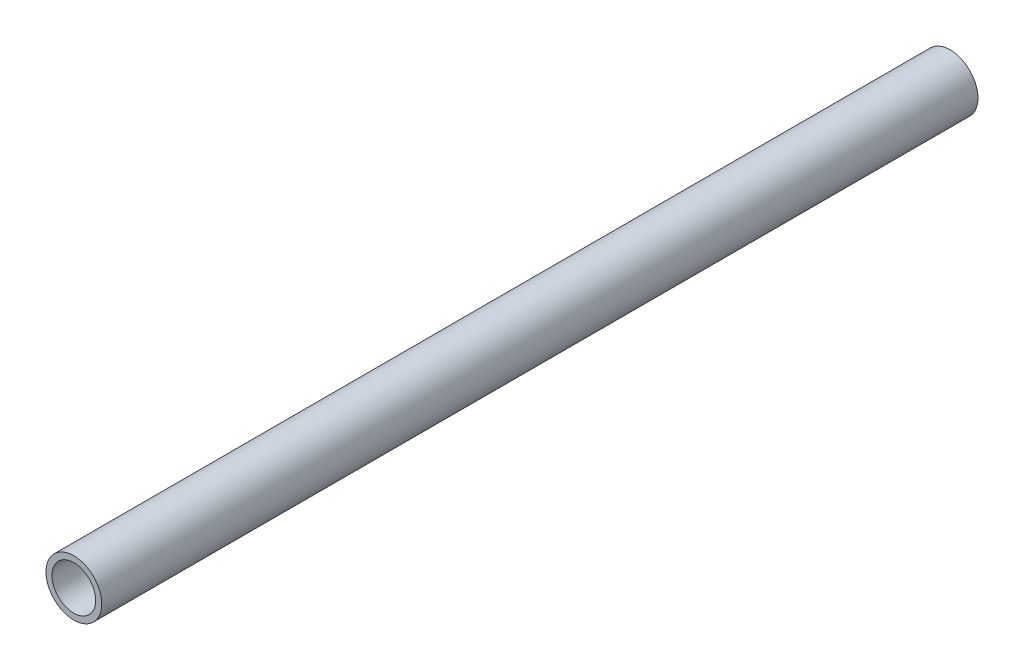
ISO-10303-21;
HEADER;
FILE_DESCRIPTION(('STEP AP214'),'2;1');
FILE_NAME('part.step','',(''),(''),'','','');
FILE_SCHEMA(('AUTOMOTIVE_DESIGN { 1 0 10303 214 1 1 1 1 }'));
ENDSEC;
DATA;
#1=APPLICATION_CONTEXT('core data for automotive mechanical design processes');
#2=APPLICATION_PROTOCOL_DEFINITION('international standard','automotive_design',2000,#1);
#3=PRODUCT_CONTEXT('',#1,'mechanical');
#4=PRODUCT('Part','Part','',(#3));
#5=PRODUCT_RELATED_PRODUCT_CATEGORY('part','',(#4));
#6=PRODUCT_DEFINITION_FORMATION('','',#4);
#7=PRODUCT_DEFINITION_CONTEXT('part definition',#1,'design');
#8=PRODUCT_DEFINITION('design','',#6,#7);
#9=PRODUCT_DEFINITION_SHAPE('','',#8);
#10=(LENGTH_UNIT() NAMED_UNIT(*) SI_UNIT(.MILLI.,.METRE.));
#11=(NAMED_UNIT(*) PLANE_ANGLE_UNIT() SI_UNIT($,.RADIAN.));
#12=(NAMED_UNIT(*) SI_UNIT($,.STERADIAN.) SOLID_ANGLE_UNIT());
#13=UNCERTAINTY_MEASURE_WITH_UNIT(LENGTH_MEASURE(1.E-05),#10,'distance_accuracy_value','');
#14=(GEOMETRIC_REPRESENTATION_CONTEXT(3) GLOBAL_UNCERTAINTY_ASSIGNED_CONTEXT((#13)) GLOBAL_UNIT_ASSIGNED_CONTEXT((#10,
#11,#12)) REPRESENTATION_CONTEXT('',''));
#15=CARTESIAN_POINT('',(0.,0.,0.));
#16=DIRECTION('',(0.,0.,1.));
#17=DIRECTION('',(1.,0.,0.));
#18=AXIS2_PLACEMENT_3D('',#15,#16,#17);
#19=CARTESIAN_POINT('',(0.,0.,419.1));
#20=DIRECTION('',(0.,0.,1.));
#21=DIRECTION('',(1.,0.,0.));
#22=AXIS2_PLACEMENT_3D('',#19,#20,#21);
#23=PLANE('',#22);
#24=CARTESIAN_POINT('',(0.,0.,419.1));
#25=DIRECTION('',(0.,0.,1.));
#26=DIRECTION('',(1.,0.,0.));
#27=AXIS2_PLACEMENT_3D('',#24,#25,#26);
#28=CIRCLE('',#27,13.335);
#29=CARTESIAN_POINT('',(13.335,0.,419.1));
#30=VERTEX_POINT('',#29);
#31=EDGE_CURVE('E10',#30,#30,#28,.T.);
#32=ORIENTED_EDGE('',*,*,#31,.T.);
#33=EDGE_LOOP('',(#32));
#34=FACE_BOUND('',#33,.T.);
#35=CARTESIAN_POINT('',(0.,0.,419.1));
#36=DIRECTION('',(0.,0.,1.));
#37=DIRECTION('',(1.,0.,0.));
#38=AXIS2_PLACEMENT_3D('',#35,#36,#37);
#39=CIRCLE('',#38,10.4648);
#40=CARTESIAN_POINT('',(10.4648,0.,419.1));
#41=VERTEX_POINT('',#40);
#42=EDGE_CURVE('E39',#41,#41,#39,.T.);
#43=ORIENTED_EDGE('',*,*,#42,.F.);
#44=EDGE_LOOP('',(#43));
#45=FACE_BOUND('',#44,.T.);
#46=ADVANCED_FACE('F28',(#34,#45),#23,.T.);
#47=CARTESIAN_POINT('',(0.,0.,0.));
#48=DIRECTION('',(0.,0.,1.));
#49=DIRECTION('',(1.,0.,0.));
#50=AXIS2_PLACEMENT_3D('',#47,#48,#49);
#51=PLANE('',#50);
#52=CARTESIAN_POINT('',(0.,0.,0.));
#53=DIRECTION('',(0.,0.,1.));
#54=DIRECTION('',(1.,0.,0.));
#55=AXIS2_PLACEMENT_3D('',#52,#53,#54);
#56=CIRCLE('',#55,13.335);
#57=CARTESIAN_POINT('',(13.335,0.,0.));
#58=VERTEX_POINT('',#57);
#59=EDGE_CURVE('E32',#58,#58,#56,.T.);
#60=ORIENTED_EDGE('',*,*,#59,.F.);
#61=EDGE_LOOP('',(#60));
#62=FACE_BOUND('',#61,.T.);
#63=CARTESIAN_POINT('',(0.,0.,0.));
#64=DIRECTION('',(0.,0.,1.));
#65=DIRECTION('',(1.,0.,0.));
#66=AXIS2_PLACEMENT_3D('',#63,#64,#65);
#67=CIRCLE('',#66,10.4648);
#68=CARTESIAN_POINT('',(10.4648,0.,0.));
#69=VERTEX_POINT('',#68);
#70=EDGE_CURVE('E41',#69,#69,#67,.T.);
#71=ORIENTED_EDGE('',*,*,#70,.T.);
#72=EDGE_LOOP('',(#71));
#73=FACE_BOUND('',#72,.T.);
#74=ADVANCED_FACE('F51',(#62,#73),#51,.F.);
#75=CARTESIAN_POINT('',(0.,0.,419.1));
#76=DIRECTION('',(0.,0.,-1.));
#77=DIRECTION('',(-1.,0.,0.));
#78=AXIS2_PLACEMENT_3D('',#75,#76,#77);
#79=CYLINDRICAL_SURFACE('',#78,13.335);
#80=ORIENTED_EDGE('',*,*,#31,.F.);
#81=EDGE_LOOP('',(#80));
#82=FACE_BOUND('',#81,.T.);
#83=ORIENTED_EDGE('',*,*,#59,.T.);
#84=EDGE_LOOP('',(#83));
#85=FACE_BOUND('',#84,.T.);
#86=ADVANCED_FACE('F30',(#82,#85),#79,.T.);
#87=CARTESIAN_POINT('',(0.,0.,419.1));
#88=DIRECTION('',(0.,0.,-1.));
#89=DIRECTION('',(-1.,0.,0.));
#90=AXIS2_PLACEMENT_3D('',#87,#88,#89);
#91=CYLINDRICAL_SURFACE('',#90,10.4648);
#92=ORIENTED_EDGE('',*,*,#42,.T.);
#93=EDGE_LOOP('',(#92));
#94=FACE_BOUND('',#93,.T.);
#95=ORIENTED_EDGE('',*,*,#70,.F.);
#96=EDGE_LOOP('',(#95));
#97=FACE_BOUND('',#96,.T.);
#98=ADVANCED_FACE('F47',(#94,#97),#91,.F.);
#99=CLOSED_SHELL('',(#46,#74,#86,#98));
#100=MANIFOLD_SOLID_BREP('B2',#99);
#101=ADVANCED_BREP_SHAPE_REPRESENTATION('',(#18,#100),#14);
#102=SHAPE_DEFINITION_REPRESENTATION(#9,#101);
ENDSEC;
END-ISO-10303-21;
